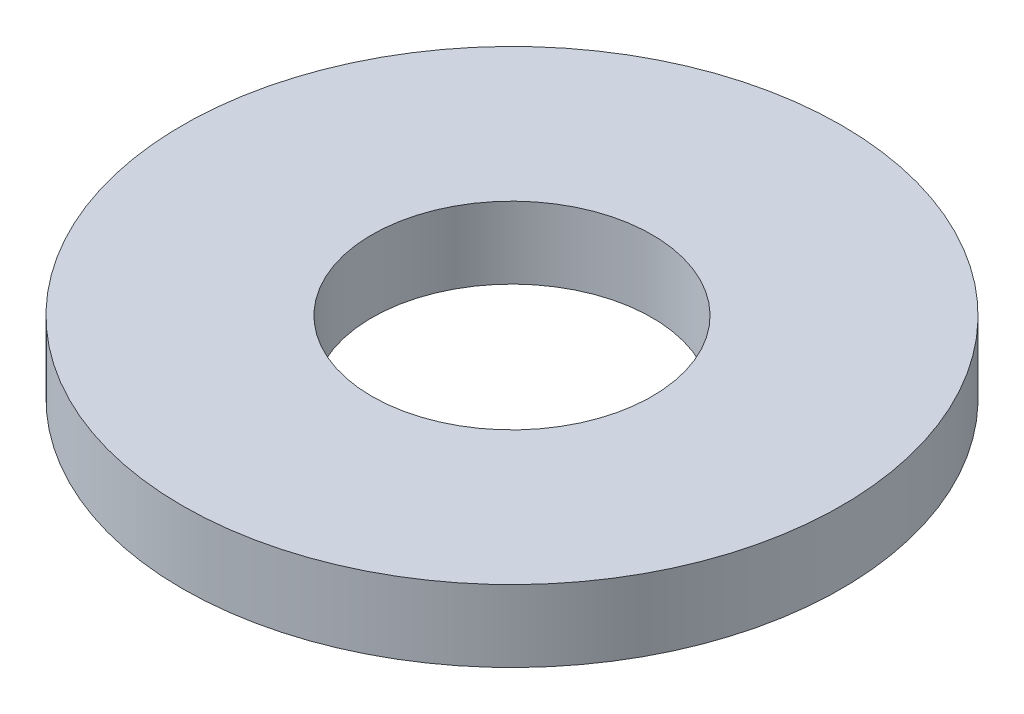
ISO-10303-21;
HEADER;
FILE_DESCRIPTION(('STEP AP214'),'2;1');
FILE_NAME('part.step','',(''),(''),'','','');
FILE_SCHEMA(('AUTOMOTIVE_DESIGN { 1 0 10303 214 1 1 1 1 }'));
ENDSEC;
DATA;
#1=APPLICATION_CONTEXT('core data for automotive mechanical design processes');
#2=APPLICATION_PROTOCOL_DEFINITION('international standard','automotive_design',2000,#1);
#3=PRODUCT_CONTEXT('',#1,'mechanical');
#4=PRODUCT('Part','Part','',(#3));
#5=PRODUCT_RELATED_PRODUCT_CATEGORY('part','',(#4));
#6=PRODUCT_DEFINITION_FORMATION('','',#4);
#7=PRODUCT_DEFINITION_CONTEXT('part definition',#1,'design');
#8=PRODUCT_DEFINITION('design','',#6,#7);
#9=PRODUCT_DEFINITION_SHAPE('','',#8);
#10=(LENGTH_UNIT() NAMED_UNIT(*) SI_UNIT(.MILLI.,.METRE.));
#11=(NAMED_UNIT(*) PLANE_ANGLE_UNIT() SI_UNIT($,.RADIAN.));
#12=(NAMED_UNIT(*) SI_UNIT($,.STERADIAN.) SOLID_ANGLE_UNIT());
#13=UNCERTAINTY_MEASURE_WITH_UNIT(LENGTH_MEASURE(1.E-05),#10,'distance_accuracy_value','');
#14=(GEOMETRIC_REPRESENTATION_CONTEXT(3) GLOBAL_UNCERTAINTY_ASSIGNED_CONTEXT((#13)) GLOBAL_UNIT_ASSIGNED_CONTEXT((#10,
#11,#12)) REPRESENTATION_CONTEXT('',''));
#15=CARTESIAN_POINT('',(0.,0.,0.));
#16=DIRECTION('',(0.,0.,1.));
#17=DIRECTION('',(1.,0.,0.));
#18=AXIS2_PLACEMENT_3D('',#15,#16,#17);
#19=CARTESIAN_POINT('',(0.,2.032,0.));
#20=DIRECTION('',(0.,-1.,0.));
#21=DIRECTION('',(0.,0.,-1.));
#22=AXIS2_PLACEMENT_3D('',#19,#20,#21);
#23=CYLINDRICAL_SURFACE('',#22,9.3218);
#24=CARTESIAN_POINT('',(0.,2.032,0.));
#25=DIRECTION('',(0.,1.,0.));
#26=DIRECTION('',(0.,0.,1.));
#27=AXIS2_PLACEMENT_3D('',#24,#25,#26);
#28=CIRCLE('',#27,9.3218);
#29=CARTESIAN_POINT('',(0.,2.032,9.3218));
#30=VERTEX_POINT('',#29);
#31=EDGE_CURVE('E10',#30,#30,#28,.T.);
#32=ORIENTED_EDGE('',*,*,#31,.F.);
#33=EDGE_LOOP('',(#32));
#34=FACE_BOUND('',#33,.T.);
#35=CARTESIAN_POINT('',(0.,0.,0.));
#36=DIRECTION('',(0.,1.,0.));
#37=DIRECTION('',(0.,0.,1.));
#38=AXIS2_PLACEMENT_3D('',#35,#36,#37);
#39=CIRCLE('',#38,9.3218);
#40=CARTESIAN_POINT('',(0.,0.,9.3218));
#41=VERTEX_POINT('',#40);
#42=EDGE_CURVE('E33',#41,#41,#39,.T.);
#43=ORIENTED_EDGE('',*,*,#42,.T.);
#44=EDGE_LOOP('',(#43));
#45=FACE_BOUND('',#44,.T.);
#46=ADVANCED_FACE('F30',(#34,#45),#23,.T.);
#47=CARTESIAN_POINT('',(0.,2.032,0.));
#48=DIRECTION('',(0.,1.,0.));
#49=DIRECTION('',(0.,0.,1.));
#50=AXIS2_PLACEMENT_3D('',#47,#48,#49);
#51=PLANE('',#50);
#52=CARTESIAN_POINT('',(0.,2.032,0.));
#53=DIRECTION('',(0.,1.,0.));
#54=DIRECTION('',(0.,0.,1.));
#55=AXIS2_PLACEMENT_3D('',#52,#53,#54);
#56=CIRCLE('',#55,3.9624);
#57=CARTESIAN_POINT('',(0.,2.032,3.9624));
#58=VERTEX_POINT('',#57);
#59=EDGE_CURVE('E42',#58,#58,#56,.T.);
#60=ORIENTED_EDGE('',*,*,#59,.F.);
#61=EDGE_LOOP('',(#60));
#62=FACE_BOUND('',#61,.T.);
#63=ORIENTED_EDGE('',*,*,#31,.T.);
#64=EDGE_LOOP('',(#63));
#65=FACE_BOUND('',#64,.T.);
#66=ADVANCED_FACE('F57',(#62,#65),#51,.T.);
#67=CARTESIAN_POINT('',(0.,0.,0.));
#68=DIRECTION('',(0.,1.,0.));
#69=DIRECTION('',(0.,0.,1.));
#70=AXIS2_PLACEMENT_3D('',#67,#68,#69);
#71=PLANE('',#70);
#72=CARTESIAN_POINT('',(0.,0.,0.));
#73=DIRECTION('',(0.,1.,0.));
#74=DIRECTION('',(0.,0.,1.));
#75=AXIS2_PLACEMENT_3D('',#72,#73,#74);
#76=CIRCLE('',#75,3.9624);
#77=CARTESIAN_POINT('',(0.,0.,3.9624));
#78=VERTEX_POINT('',#77);
#79=EDGE_CURVE('E40',#78,#78,#76,.T.);
#80=ORIENTED_EDGE('',*,*,#79,.T.);
#81=EDGE_LOOP('',(#80));
#82=FACE_BOUND('',#81,.T.);
#83=ORIENTED_EDGE('',*,*,#42,.F.);
#84=EDGE_LOOP('',(#83));
#85=FACE_BOUND('',#84,.T.);
#86=ADVANCED_FACE('F48',(#82,#85),#71,.F.);
#87=CARTESIAN_POINT('',(0.,0.,0.));
#88=DIRECTION('',(0.,1.,0.));
#89=DIRECTION('',(0.,0.,1.));
#90=AXIS2_PLACEMENT_3D('',#87,#88,#89);
#91=CYLINDRICAL_SURFACE('',#90,3.9624);
#92=ORIENTED_EDGE('',*,*,#79,.F.);
#93=EDGE_LOOP('',(#92));
#94=FACE_BOUND('',#93,.T.);
#95=ORIENTED_EDGE('',*,*,#59,.T.);
#96=EDGE_LOOP('',(#95));
#97=FACE_BOUND('',#96,.T.);
#98=ADVANCED_FACE('F51',(#94,#97),#91,.F.);
#99=CLOSED_SHELL('',(#46,#66,#86,#98));
#100=MANIFOLD_SOLID_BREP('B2',#99);
#101=ADVANCED_BREP_SHAPE_REPRESENTATION('',(#18,#100),#14);
#102=SHAPE_DEFINITION_REPRESENTATION(#9,#101);
ENDSEC;
END-ISO-10303-21;
